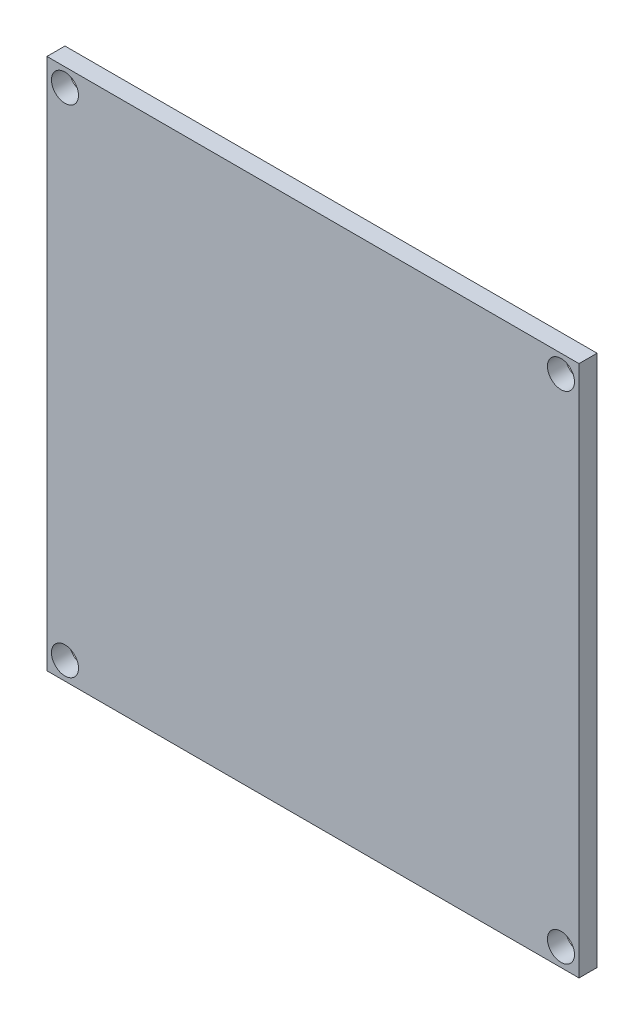
ISO-10303-21;
HEADER;
FILE_DESCRIPTION(('STEP AP214'),'2;1');
FILE_NAME('part.step','',(''),(''),'','','');
FILE_SCHEMA(('AUTOMOTIVE_DESIGN { 1 0 10303 214 1 1 1 1 }'));
ENDSEC;
DATA;
#1=APPLICATION_CONTEXT('core data for automotive mechanical design processes');
#2=APPLICATION_PROTOCOL_DEFINITION('international standard','automotive_design',2000,#1);
#3=PRODUCT_CONTEXT('',#1,'mechanical');
#4=PRODUCT('Part','Part','',(#3));
#5=PRODUCT_RELATED_PRODUCT_CATEGORY('part','',(#4));
#6=PRODUCT_DEFINITION_FORMATION('','',#4);
#7=PRODUCT_DEFINITION_CONTEXT('part definition',#1,'design');
#8=PRODUCT_DEFINITION('design','',#6,#7);
#9=PRODUCT_DEFINITION_SHAPE('','',#8);
#10=(LENGTH_UNIT() NAMED_UNIT(*) SI_UNIT(.MILLI.,.METRE.));
#11=(NAMED_UNIT(*) PLANE_ANGLE_UNIT() SI_UNIT($,.RADIAN.));
#12=(NAMED_UNIT(*) SI_UNIT($,.STERADIAN.) SOLID_ANGLE_UNIT());
#13=UNCERTAINTY_MEASURE_WITH_UNIT(LENGTH_MEASURE(1.E-05),#10,'distance_accuracy_value','');
#14=(GEOMETRIC_REPRESENTATION_CONTEXT(3) GLOBAL_UNCERTAINTY_ASSIGNED_CONTEXT((#13)) GLOBAL_UNIT_ASSIGNED_CONTEXT((#10,
#11,#12)) REPRESENTATION_CONTEXT('',''));
#15=CARTESIAN_POINT('',(0.,0.,0.));
#16=DIRECTION('',(0.,0.,1.));
#17=DIRECTION('',(1.,0.,0.));
#18=AXIS2_PLACEMENT_3D('',#15,#16,#17);
#19=CARTESIAN_POINT('',(0.,0.,2.));
#20=DIRECTION('',(0.,0.,1.));
#21=DIRECTION('',(1.,0.,0.));
#22=AXIS2_PLACEMENT_3D('',#19,#20,#21);
#23=PLANE('',#22);
#24=CARTESIAN_POINT('',(-32.1418845188903,-26.5111731843575,2.));
#25=DIRECTION('',(0.,0.,1.));
#26=DIRECTION('',(1.,0.,0.));
#27=AXIS2_PLACEMENT_3D('',#24,#25,#26);
#28=CIRCLE('',#27,1.5);
#29=CARTESIAN_POINT('',(-30.6418845188903,-26.5111731843575,2.));
#30=VERTEX_POINT('',#29);
#31=EDGE_CURVE('E121',#30,#30,#28,.T.);
#32=ORIENTED_EDGE('',*,*,#31,.F.);
#33=EDGE_LOOP('',(#32));
#34=FACE_BOUND('',#33,.T.);
#35=CARTESIAN_POINT('',(-87.1418845188909,28.4888268156425,2.));
#36=DIRECTION('',(0.,0.,1.));
#37=DIRECTION('',(1.,0.,0.));
#38=AXIS2_PLACEMENT_3D('',#35,#36,#37);
#39=CIRCLE('',#38,1.5);
#40=CARTESIAN_POINT('',(-85.6418845188909,28.4888268156425,2.));
#41=VERTEX_POINT('',#40);
#42=EDGE_CURVE('E100',#41,#41,#39,.T.);
#43=ORIENTED_EDGE('',*,*,#42,.F.);
#44=EDGE_LOOP('',(#43));
#45=FACE_BOUND('',#44,.T.);
#46=DIRECTION('',(0.,-1.,0.));
#47=VECTOR('',#46,1.);
#48=CARTESIAN_POINT('',(-89.1418845188909,30.4888268156425,2.));
#49=LINE('',#48,#47);
#50=CARTESIAN_POINT('',(-89.1418845188909,30.4888268156425,2.));
#51=VERTEX_POINT('',#50);
#52=CARTESIAN_POINT('',(-89.1418845188909,-28.5111731843575,2.));
#53=VERTEX_POINT('',#52);
#54=EDGE_CURVE('E85',#51,#53,#49,.T.);
#55=ORIENTED_EDGE('',*,*,#54,.T.);
#56=DIRECTION('',(1.,0.,0.));
#57=VECTOR('',#56,1.);
#58=CARTESIAN_POINT('',(-89.1418845188909,-28.5111731843575,2.));
#59=LINE('',#58,#57);
#60=CARTESIAN_POINT('',(-30.1418845188909,-28.5111731843575,2.));
#61=VERTEX_POINT('',#60);
#62=EDGE_CURVE('E80',#53,#61,#59,.T.);
#63=ORIENTED_EDGE('',*,*,#62,.T.);
#64=DIRECTION('',(0.,1.,0.));
#65=VECTOR('',#64,1.);
#66=CARTESIAN_POINT('',(-30.1418845188909,30.4888268156425,2.));
#67=LINE('',#66,#65);
#68=CARTESIAN_POINT('',(-30.1418845188909,30.4888268156425,2.));
#69=VERTEX_POINT('',#68);
#70=EDGE_CURVE('E83',#61,#69,#67,.T.);
#71=ORIENTED_EDGE('',*,*,#70,.T.);
#72=DIRECTION('',(-1.,0.,0.));
#73=VECTOR('',#72,1.);
#74=CARTESIAN_POINT('',(-89.1418845188909,30.4888268156425,2.));
#75=LINE('',#74,#73);
#76=EDGE_CURVE('E50',#69,#51,#75,.T.);
#77=ORIENTED_EDGE('',*,*,#76,.T.);
#78=EDGE_LOOP('',(#55,#63,#71,#77));
#79=FACE_BOUND('',#78,.T.);
#80=CARTESIAN_POINT('',(-32.1418845188909,28.4888268156425,2.));
#81=DIRECTION('',(0.,0.,1.));
#82=DIRECTION('',(1.,0.,0.));
#83=AXIS2_PLACEMENT_3D('',#80,#81,#82);
#84=CIRCLE('',#83,1.5);
#85=CARTESIAN_POINT('',(-30.6418845188909,28.4888268156425,2.));
#86=VERTEX_POINT('',#85);
#87=EDGE_CURVE('E115',#86,#86,#84,.T.);
#88=ORIENTED_EDGE('',*,*,#87,.F.);
#89=EDGE_LOOP('',(#88));
#90=FACE_BOUND('',#89,.T.);
#91=CARTESIAN_POINT('',(-87.1418845188903,-26.5111731843575,2.));
#92=DIRECTION('',(0.,0.,1.));
#93=DIRECTION('',(1.,0.,0.));
#94=AXIS2_PLACEMENT_3D('',#91,#92,#93);
#95=CIRCLE('',#94,1.5);
#96=CARTESIAN_POINT('',(-85.6418845188903,-26.5111731843575,2.));
#97=VERTEX_POINT('',#96);
#98=EDGE_CURVE('E127',#97,#97,#95,.T.);
#99=ORIENTED_EDGE('',*,*,#98,.F.);
#100=EDGE_LOOP('',(#99));
#101=FACE_BOUND('',#100,.T.);
#102=ADVANCED_FACE('F33',(#34,#45,#79,#90,#101),#23,.T.);
#103=CARTESIAN_POINT('',(0.,0.,0.));
#104=DIRECTION('',(0.,0.,1.));
#105=DIRECTION('',(1.,0.,0.));
#106=AXIS2_PLACEMENT_3D('',#103,#104,#105);
#107=PLANE('',#106);
#108=DIRECTION('',(0.,-1.,0.));
#109=VECTOR('',#108,1.);
#110=CARTESIAN_POINT('',(-89.1418845188909,30.4888268156425,0.));
#111=LINE('',#110,#109);
#112=CARTESIAN_POINT('',(-89.1418845188909,30.4888268156425,0.));
#113=VERTEX_POINT('',#112);
#114=CARTESIAN_POINT('',(-89.1418845188909,-28.5111731843575,0.));
#115=VERTEX_POINT('',#114);
#116=EDGE_CURVE('E97',#113,#115,#111,.T.);
#117=ORIENTED_EDGE('',*,*,#116,.F.);
#118=DIRECTION('',(-1.,0.,0.));
#119=VECTOR('',#118,1.);
#120=CARTESIAN_POINT('',(-89.1418845188909,30.4888268156425,0.));
#121=LINE('',#120,#119);
#122=CARTESIAN_POINT('',(-30.1418845188909,30.4888268156425,0.));
#123=VERTEX_POINT('',#122);
#124=EDGE_CURVE('E73',#123,#113,#121,.T.);
#125=ORIENTED_EDGE('',*,*,#124,.F.);
#126=DIRECTION('',(0.,1.,0.));
#127=VECTOR('',#126,1.);
#128=CARTESIAN_POINT('',(-30.1418845188909,30.4888268156425,0.));
#129=LINE('',#128,#127);
#130=CARTESIAN_POINT('',(-30.1418845188909,-28.5111731843575,0.));
#131=VERTEX_POINT('',#130);
#132=EDGE_CURVE('E67',#131,#123,#129,.T.);
#133=ORIENTED_EDGE('',*,*,#132,.F.);
#134=DIRECTION('',(1.,0.,0.));
#135=VECTOR('',#134,1.);
#136=CARTESIAN_POINT('',(-89.1418845188909,-28.5111731843575,0.));
#137=LINE('',#136,#135);
#138=EDGE_CURVE('E89',#115,#131,#137,.T.);
#139=ORIENTED_EDGE('',*,*,#138,.F.);
#140=EDGE_LOOP('',(#117,#125,#133,#139));
#141=FACE_BOUND('',#140,.T.);
#142=CARTESIAN_POINT('',(-87.1418845188909,28.4888268156425,0.));
#143=DIRECTION('',(0.,0.,1.));
#144=DIRECTION('',(1.,0.,0.));
#145=AXIS2_PLACEMENT_3D('',#142,#143,#144);
#146=CIRCLE('',#145,1.5);
#147=CARTESIAN_POINT('',(-85.6418845188909,28.4888268156425,0.));
#148=VERTEX_POINT('',#147);
#149=EDGE_CURVE('E112',#148,#148,#146,.T.);
#150=ORIENTED_EDGE('',*,*,#149,.T.);
#151=EDGE_LOOP('',(#150));
#152=FACE_BOUND('',#151,.T.);
#153=CARTESIAN_POINT('',(-32.1418845188909,28.4888268156425,0.));
#154=DIRECTION('',(0.,0.,1.));
#155=DIRECTION('',(1.,0.,0.));
#156=AXIS2_PLACEMENT_3D('',#153,#154,#155);
#157=CIRCLE('',#156,1.5);
#158=CARTESIAN_POINT('',(-30.6418845188909,28.4888268156425,0.));
#159=VERTEX_POINT('',#158);
#160=EDGE_CURVE('E118',#159,#159,#157,.T.);
#161=ORIENTED_EDGE('',*,*,#160,.T.);
#162=EDGE_LOOP('',(#161));
#163=FACE_BOUND('',#162,.T.);
#164=CARTESIAN_POINT('',(-32.1418845188903,-26.5111731843575,0.));
#165=DIRECTION('',(0.,0.,1.));
#166=DIRECTION('',(1.,0.,0.));
#167=AXIS2_PLACEMENT_3D('',#164,#165,#166);
#168=CIRCLE('',#167,1.5);
#169=CARTESIAN_POINT('',(-30.6418845188903,-26.5111731843575,0.));
#170=VERTEX_POINT('',#169);
#171=EDGE_CURVE('E124',#170,#170,#168,.T.);
#172=ORIENTED_EDGE('',*,*,#171,.T.);
#173=EDGE_LOOP('',(#172));
#174=FACE_BOUND('',#173,.T.);
#175=CARTESIAN_POINT('',(-87.1418845188903,-26.5111731843575,0.));
#176=DIRECTION('',(0.,0.,1.));
#177=DIRECTION('',(1.,0.,0.));
#178=AXIS2_PLACEMENT_3D('',#175,#176,#177);
#179=CIRCLE('',#178,1.5);
#180=CARTESIAN_POINT('',(-85.6418845188903,-26.5111731843575,0.));
#181=VERTEX_POINT('',#180);
#182=EDGE_CURVE('E130',#181,#181,#179,.T.);
#183=ORIENTED_EDGE('',*,*,#182,.T.);
#184=EDGE_LOOP('',(#183));
#185=FACE_BOUND('',#184,.T.);
#186=ADVANCED_FACE('F108',(#141,#152,#163,#174,#185),#107,.F.);
#187=CARTESIAN_POINT('',(-89.1418845188909,30.4888268156425,2.));
#188=DIRECTION('',(1.,0.,0.));
#189=DIRECTION('',(0.,1.,0.));
#190=AXIS2_PLACEMENT_3D('',#187,#188,#189);
#191=PLANE('',#190);
#192=ORIENTED_EDGE('',*,*,#116,.T.);
#193=DIRECTION('',(0.,0.,-1.));
#194=VECTOR('',#193,1.);
#195=CARTESIAN_POINT('',(-89.1418845188909,-28.5111731843575,2.));
#196=LINE('',#195,#194);
#197=EDGE_CURVE('E11',#53,#115,#196,.T.);
#198=ORIENTED_EDGE('',*,*,#197,.F.);
#199=ORIENTED_EDGE('',*,*,#54,.F.);
#200=DIRECTION('',(0.,0.,-1.));
#201=VECTOR('',#200,1.);
#202=CARTESIAN_POINT('',(-89.1418845188909,30.4888268156425,2.));
#203=LINE('',#202,#201);
#204=EDGE_CURVE('E93',#51,#113,#203,.T.);
#205=ORIENTED_EDGE('',*,*,#204,.T.);
#206=EDGE_LOOP('',(#192,#198,#199,#205));
#207=FACE_BOUND('',#206,.T.);
#208=ADVANCED_FACE('F35',(#207),#191,.F.);
#209=CARTESIAN_POINT('',(-89.1418845188909,-28.5111731843575,2.));
#210=DIRECTION('',(0.,1.,0.));
#211=DIRECTION('',(0.,0.,1.));
#212=AXIS2_PLACEMENT_3D('',#209,#210,#211);
#213=PLANE('',#212);
#214=ORIENTED_EDGE('',*,*,#138,.T.);
#215=DIRECTION('',(0.,0.,-1.));
#216=VECTOR('',#215,1.);
#217=CARTESIAN_POINT('',(-30.1418845188909,-28.5111731843575,2.));
#218=LINE('',#217,#216);
#219=EDGE_CURVE('E42',#61,#131,#218,.T.);
#220=ORIENTED_EDGE('',*,*,#219,.F.);
#221=ORIENTED_EDGE('',*,*,#62,.F.);
#222=ORIENTED_EDGE('',*,*,#197,.T.);
#223=EDGE_LOOP('',(#214,#220,#221,#222));
#224=FACE_BOUND('',#223,.T.);
#225=ADVANCED_FACE('F88',(#224),#213,.F.);
#226=CARTESIAN_POINT('',(-30.1418845188909,30.4888268156425,2.));
#227=DIRECTION('',(-1.,0.,0.));
#228=DIRECTION('',(0.,0.,1.));
#229=AXIS2_PLACEMENT_3D('',#226,#227,#228);
#230=PLANE('',#229);
#231=ORIENTED_EDGE('',*,*,#132,.T.);
#232=DIRECTION('',(0.,0.,-1.));
#233=VECTOR('',#232,1.);
#234=CARTESIAN_POINT('',(-30.1418845188909,30.4888268156425,2.));
#235=LINE('',#234,#233);
#236=EDGE_CURVE('E90',#69,#123,#235,.T.);
#237=ORIENTED_EDGE('',*,*,#236,.F.);
#238=ORIENTED_EDGE('',*,*,#70,.F.);
#239=ORIENTED_EDGE('',*,*,#219,.T.);
#240=EDGE_LOOP('',(#231,#237,#238,#239));
#241=FACE_BOUND('',#240,.T.);
#242=ADVANCED_FACE('F91',(#241),#230,.F.);
#243=CARTESIAN_POINT('',(-89.1418845188909,30.4888268156425,2.));
#244=DIRECTION('',(0.,-1.,0.));
#245=DIRECTION('',(0.,0.,-1.));
#246=AXIS2_PLACEMENT_3D('',#243,#244,#245);
#247=PLANE('',#246);
#248=ORIENTED_EDGE('',*,*,#124,.T.);
#249=ORIENTED_EDGE('',*,*,#204,.F.);
#250=ORIENTED_EDGE('',*,*,#76,.F.);
#251=ORIENTED_EDGE('',*,*,#236,.T.);
#252=EDGE_LOOP('',(#248,#249,#250,#251));
#253=FACE_BOUND('',#252,.T.);
#254=ADVANCED_FACE('F105',(#253),#247,.F.);
#255=CARTESIAN_POINT('',(-87.1418845188909,28.4888268156425,2.));
#256=DIRECTION('',(0.,0.,-1.));
#257=DIRECTION('',(-1.,0.,0.));
#258=AXIS2_PLACEMENT_3D('',#255,#256,#257);
#259=CYLINDRICAL_SURFACE('',#258,1.5);
#260=ORIENTED_EDGE('',*,*,#42,.T.);
#261=EDGE_LOOP('',(#260));
#262=FACE_BOUND('',#261,.T.);
#263=ORIENTED_EDGE('',*,*,#149,.F.);
#264=EDGE_LOOP('',(#263));
#265=FACE_BOUND('',#264,.T.);
#266=ADVANCED_FACE('F149',(#262,#265),#259,.F.);
#267=CARTESIAN_POINT('',(-32.1418845188909,28.4888268156425,2.));
#268=DIRECTION('',(0.,0.,-1.));
#269=DIRECTION('',(-1.,0.,0.));
#270=AXIS2_PLACEMENT_3D('',#267,#268,#269);
#271=CYLINDRICAL_SURFACE('',#270,1.5);
#272=ORIENTED_EDGE('',*,*,#87,.T.);
#273=EDGE_LOOP('',(#272));
#274=FACE_BOUND('',#273,.T.);
#275=ORIENTED_EDGE('',*,*,#160,.F.);
#276=EDGE_LOOP('',(#275));
#277=FACE_BOUND('',#276,.T.);
#278=ADVANCED_FACE('F201',(#274,#277),#271,.F.);
#279=CARTESIAN_POINT('',(-32.1418845188903,-26.5111731843575,2.));
#280=DIRECTION('',(0.,0.,-1.));
#281=DIRECTION('',(-1.,0.,0.));
#282=AXIS2_PLACEMENT_3D('',#279,#280,#281);
#283=CYLINDRICAL_SURFACE('',#282,1.5);
#284=ORIENTED_EDGE('',*,*,#31,.T.);
#285=EDGE_LOOP('',(#284));
#286=FACE_BOUND('',#285,.T.);
#287=ORIENTED_EDGE('',*,*,#171,.F.);
#288=EDGE_LOOP('',(#287));
#289=FACE_BOUND('',#288,.T.);
#290=ADVANCED_FACE('F209',(#286,#289),#283,.F.);
#291=CARTESIAN_POINT('',(-87.1418845188903,-26.5111731843575,2.));
#292=DIRECTION('',(0.,0.,-1.));
#293=DIRECTION('',(-1.,0.,0.));
#294=AXIS2_PLACEMENT_3D('',#291,#292,#293);
#295=CYLINDRICAL_SURFACE('',#294,1.5);
#296=ORIENTED_EDGE('',*,*,#98,.T.);
#297=EDGE_LOOP('',(#296));
#298=FACE_BOUND('',#297,.T.);
#299=ORIENTED_EDGE('',*,*,#182,.F.);
#300=EDGE_LOOP('',(#299));
#301=FACE_BOUND('',#300,.T.);
#302=ADVANCED_FACE('F136',(#298,#301),#295,.F.);
#303=CLOSED_SHELL('',(#102,#186,#208,#225,#242,#254,#266,#278,#290,#302));
#304=MANIFOLD_SOLID_BREP('B2',#303);
#305=ADVANCED_BREP_SHAPE_REPRESENTATION('',(#18,#304),#14);
#306=SHAPE_DEFINITION_REPRESENTATION(#9,#305);
ENDSEC;
END-ISO-10303-21;
